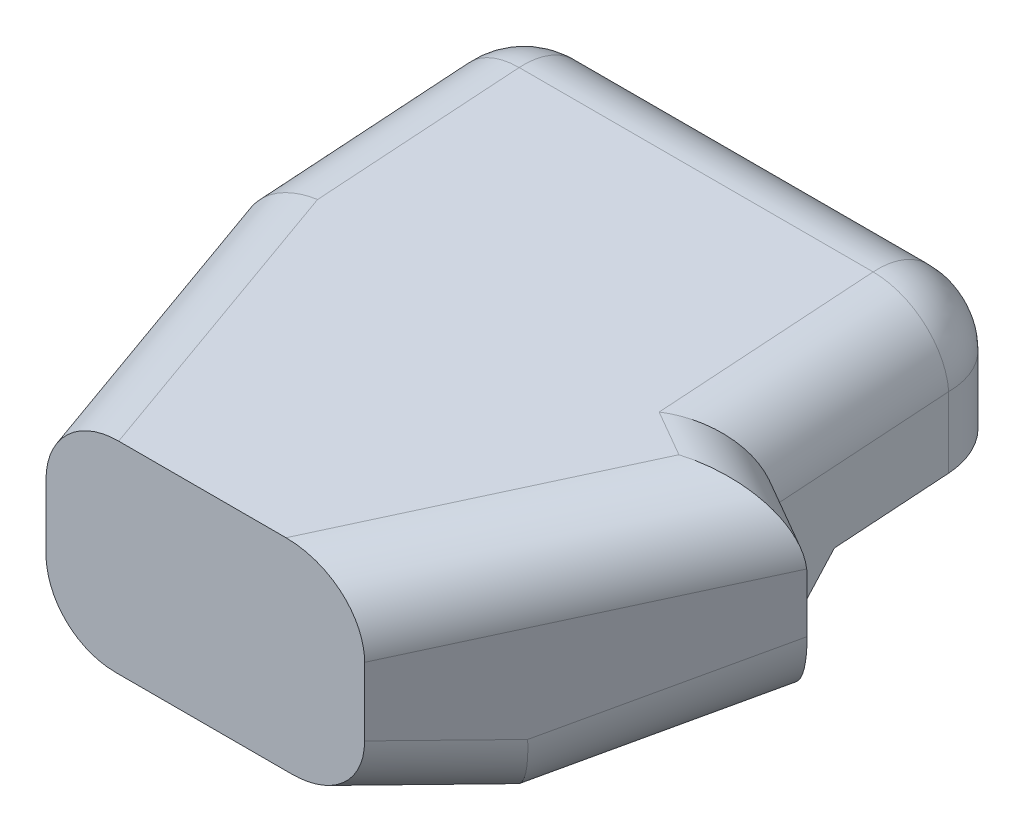
ISO-10303-21;
HEADER;
FILE_DESCRIPTION(('STEP AP214'),'2;1');
FILE_NAME('part.step','',(''),(''),'','','');
FILE_SCHEMA(('AUTOMOTIVE_DESIGN { 1 0 10303 214 1 1 1 1 }'));
ENDSEC;
DATA;
#1=APPLICATION_CONTEXT('core data for automotive mechanical design processes');
#2=APPLICATION_PROTOCOL_DEFINITION('international standard','automotive_design',2000,#1);
#3=PRODUCT_CONTEXT('',#1,'mechanical');
#4=PRODUCT('Part','Part','',(#3));
#5=PRODUCT_RELATED_PRODUCT_CATEGORY('part','',(#4));
#6=PRODUCT_DEFINITION_FORMATION('','',#4);
#7=PRODUCT_DEFINITION_CONTEXT('part definition',#1,'design');
#8=PRODUCT_DEFINITION('design','',#6,#7);
#9=PRODUCT_DEFINITION_SHAPE('','',#8);
#10=(LENGTH_UNIT() NAMED_UNIT(*) SI_UNIT(.MILLI.,.METRE.));
#11=(NAMED_UNIT(*) PLANE_ANGLE_UNIT() SI_UNIT($,.RADIAN.));
#12=(NAMED_UNIT(*) SI_UNIT($,.STERADIAN.) SOLID_ANGLE_UNIT());
#13=UNCERTAINTY_MEASURE_WITH_UNIT(LENGTH_MEASURE(1.E-05),#10,'distance_accuracy_value','');
#14=(GEOMETRIC_REPRESENTATION_CONTEXT(3) GLOBAL_UNCERTAINTY_ASSIGNED_CONTEXT((#13)) GLOBAL_UNIT_ASSIGNED_CONTEXT((#10,
#11,#12)) REPRESENTATION_CONTEXT('',''));
#15=CARTESIAN_POINT('',(0.,0.,0.));
#16=DIRECTION('',(0.,0.,1.));
#17=DIRECTION('',(1.,0.,0.));
#18=AXIS2_PLACEMENT_3D('',#15,#16,#17);
#19=CARTESIAN_POINT('',(-44.45,48.26,-50.8));
#20=DIRECTION('',(1.,0.,0.));
#21=DIRECTION('',(0.,0.,-1.));
#22=AXIS2_PLACEMENT_3D('',#19,#20,#21);
#23=PLANE('',#22);
#24=DIRECTION('',(0.,0.741365955623749,-0.671100975891173));
#25=VECTOR('',#24,1.);
#26=CARTESIAN_POINT('',(-44.45,27.062088622232,-74.2173550484524));
#27=LINE('',#26,#25);
#28=CARTESIAN_POINT('',(-44.45,15.2004808970908,-63.4799635353998));
#29=VERTEX_POINT('',#28);
#30=CARTESIAN_POINT('',(-44.45,20.6329834358397,-68.3975858346573));
#31=VERTEX_POINT('',#30);
#32=EDGE_CURVE('E188',#29,#31,#27,.T.);
#33=ORIENTED_EDGE('',*,*,#32,.F.);
#34=CARTESIAN_POINT('',(-44.45,32.1617140550632,-93.3781587201701));
#35=DIRECTION('',(1.,0.,0.));
#36=DIRECTION('',(0.,-0.268871544476507,0.963176044433632));
#37=AXIS2_PLACEMENT_3D('',#34,#35,#36);
#38=ELLIPSE('',#37,44.0636100522988,12.7);
#39=CARTESIAN_POINT('',(-44.45,21.3334287185706,-50.8));
#40=VERTEX_POINT('',#39);
#41=EDGE_CURVE('E287',#29,#40,#38,.F.);
#42=ORIENTED_EDGE('',*,*,#41,.T.);
#43=DIRECTION('',(0.,-1.,0.));
#44=VECTOR('',#43,1.);
#45=CARTESIAN_POINT('',(-44.45,48.26,-50.8));
#46=LINE('',#45,#44);
#47=CARTESIAN_POINT('',(-44.45,32.1241080736787,-50.8));
#48=VERTEX_POINT('',#47);
#49=EDGE_CURVE('E199',#48,#40,#46,.T.);
#50=ORIENTED_EDGE('',*,*,#49,.F.);
#51=DIRECTION('',(0.,-0.0669235621427186,0.997758105369297));
#52=VECTOR('',#51,1.);
#53=CARTESIAN_POINT('',(-44.45,35.5884720618099,-102.449929239212));
#54=LINE('',#53,#52);
#55=CARTESIAN_POINT('',(-44.45,34.6796249909718,-88.9));
#56=VERTEX_POINT('',#55);
#57=EDGE_CURVE('E259',#48,#56,#54,.F.);
#58=ORIENTED_EDGE('',*,*,#57,.T.);
#59=DIRECTION('',(0.,-1.,0.));
#60=VECTOR('',#59,1.);
#61=CARTESIAN_POINT('',(-44.45,48.26,-88.9));
#62=LINE('',#61,#60);
#63=CARTESIAN_POINT('',(-44.45,22.008161027569,-88.9));
#64=VERTEX_POINT('',#63);
#65=EDGE_CURVE('E261',#56,#64,#62,.T.);
#66=ORIENTED_EDGE('',*,*,#65,.T.);
#67=DIRECTION('',(0.,0.0669235621427186,-0.997758105369297));
#68=VECTOR('',#67,1.);
#69=CARTESIAN_POINT('',(-44.45,19.5816654348561,-52.7235687438587));
#70=LINE('',#69,#68);
#71=EDGE_CURVE('E218',#31,#64,#70,.T.);
#72=ORIENTED_EDGE('',*,*,#71,.F.);
#73=EDGE_LOOP('',(#33,#42,#50,#58,#66,#72));
#74=FACE_BOUND('',#73,.T.);
#75=ADVANCED_FACE('F40',(#74),#23,.F.);
#76=CARTESIAN_POINT('',(-28.575,48.26,0.));
#77=DIRECTION('',(0.95447997803503,0.,-0.298274993135947));
#78=DIRECTION('',(-0.298274993135947,0.,-0.95447997803503));
#79=AXIS2_PLACEMENT_3D('',#76,#77,#78);
#80=PLANE('',#79);
#81=ORIENTED_EDGE('',*,*,#49,.T.);
#82=DIRECTION('',(-0.288219689329278,0.257461795372023,-0.922303005853689));
#83=VECTOR('',#82,1.);
#84=CARTESIAN_POINT('',(-35.4555907010625,13.29887434165,-22.0178902434001));
#85=LINE('',#84,#83);
#86=CARTESIAN_POINT('',(-35.1883635531592,13.0601648300568,-21.1627633701095));
#87=VERTEX_POINT('',#86);
#88=EDGE_CURVE('E291',#40,#87,#85,.F.);
#89=ORIENTED_EDGE('',*,*,#88,.T.);
#90=DIRECTION('',(-0.292654151843761,-0.193219752801737,-0.936493285900035));
#91=VECTOR('',#90,1.);
#92=CARTESIAN_POINT('',(-29.2640722899567,16.971573864201,-2.2050313278613));
#93=LINE('',#92,#91);
#94=CARTESIAN_POINT('',(-28.575,17.4265217154074,0.));
#95=VERTEX_POINT('',#94);
#96=EDGE_CURVE('E289',#87,#95,#93,.F.);
#97=ORIENTED_EDGE('',*,*,#96,.T.);
#98=DIRECTION('',(0.,-1.,0.));
#99=VECTOR('',#98,1.);
#100=CARTESIAN_POINT('',(-28.575,48.26,0.));
#101=LINE('',#100,#99);
#102=CARTESIAN_POINT('',(-28.575,28.9708344476093,0.));
#103=VERTEX_POINT('',#102);
#104=EDGE_CURVE('E232',#103,#95,#101,.T.);
#105=ORIENTED_EDGE('',*,*,#104,.F.);
#106=DIRECTION('',(0.297665602820913,-0.0638899303899297,0.952529929026922));
#107=VECTOR('',#106,1.);
#108=CARTESIAN_POINT('',(-44.6872370991244,32.4291100996618,-51.5591587171979));
#109=LINE('',#108,#107);
#110=CARTESIAN_POINT('',(-44.4474694857825,32.3776471963871,-50.791902354504));
#111=VERTEX_POINT('',#110);
#112=EDGE_CURVE('E277',#103,#111,#109,.F.);
#113=ORIENTED_EDGE('',*,*,#112,.T.);
#114=CARTESIAN_POINT('',(-31.75,29.3982233618993,-10.16));
#115=DIRECTION('',(0.95447997803503,0.,-0.298274993135947));
#116=DIRECTION('',(-0.297541229968866,0.0700998795093561,-0.952131935900371));
#117=AXIS2_PLACEMENT_3D('',#114,#115,#116);
#118=ELLIPSE('',#117,42.6738289481605,12.7);
#119=EDGE_CURVE('E279',#111,#48,#118,.F.);
#120=ORIENTED_EDGE('',*,*,#119,.T.);
#121=EDGE_LOOP('',(#81,#89,#97,#105,#113,#120));
#122=FACE_BOUND('',#121,.T.);
#123=ADVANCED_FACE('F396',(#122),#80,.F.);
#124=CARTESIAN_POINT('',(28.575,48.26,0.));
#125=DIRECTION('',(0.,0.,-1.));
#126=DIRECTION('',(-1.,0.,0.));
#127=AXIS2_PLACEMENT_3D('',#124,#125,#126);
#128=PLANE('',#127);
#129=ORIENTED_EDGE('',*,*,#104,.T.);
#130=CARTESIAN_POINT('',(-15.2693253999468,18.2080908847934,0.));
#131=DIRECTION('',(0.,0.,-1.));
#132=DIRECTION('',(0.834520233187556,0.550977295721509,0.));
#133=AXIS2_PLACEMENT_3D('',#130,#131,#132);
#134=ELLIPSE('',#133,13.5612290992502,12.7);
#135=CARTESIAN_POINT('',(-16.0712770544389,5.24059466848969,0.));
#136=VERTEX_POINT('',#135);
#137=EDGE_CURVE('E303',#95,#136,#134,.F.);
#138=ORIENTED_EDGE('',*,*,#137,.T.);
#139=DIRECTION('',(-1.,0.,0.));
#140=VECTOR('',#139,1.);
#141=CARTESIAN_POINT('',(82.55,5.24059466848969,0.));
#142=LINE('',#141,#140);
#143=CARTESIAN_POINT('',(15.4471999259788,5.24059466848969,0.));
#144=VERTEX_POINT('',#143);
#145=EDGE_CURVE('E216',#144,#136,#142,.T.);
#146=ORIENTED_EDGE('',*,*,#145,.F.);
#147=CARTESIAN_POINT('',(14.0036869478931,18.2080908847934,0.));
#148=DIRECTION('',(0.,0.,-1.));
#149=DIRECTION('',(0.938837131961839,-0.344361495596806,0.));
#150=AXIS2_PLACEMENT_3D('',#147,#148,#149);
#151=ELLIPSE('',#150,14.8050370544065,12.7);
#152=CARTESIAN_POINT('',(28.575,16.9234606655006,0.));
#153=VERTEX_POINT('',#152);
#154=EDGE_CURVE('E301',#144,#153,#151,.F.);
#155=ORIENTED_EDGE('',*,*,#154,.T.);
#156=DIRECTION('',(0.,-1.,0.));
#157=VECTOR('',#156,1.);
#158=CARTESIAN_POINT('',(28.575,48.26,0.));
#159=LINE('',#158,#157);
#160=CARTESIAN_POINT('',(28.575,29.1343758145459,0.));
#161=VERTEX_POINT('',#160);
#162=EDGE_CURVE('E230',#161,#153,#159,.T.);
#163=ORIENTED_EDGE('',*,*,#162,.F.);
#164=CARTESIAN_POINT('',(14.0036869478931,28.7167521839545,0.));
#165=DIRECTION('',(0.,0.,-1.));
#166=DIRECTION('',(-0.992965534941179,-0.118403743264215,0.));
#167=AXIS2_PLACEMENT_3D('',#164,#165,#166);
#168=ELLIPSE('',#167,14.5961910681332,12.7);
#169=CARTESIAN_POINT('',(14.4817721449502,41.4452882205517,0.));
#170=VERTEX_POINT('',#169);
#171=EDGE_CURVE('E255',#161,#170,#168,.F.);
#172=ORIENTED_EDGE('',*,*,#171,.T.);
#173=DIRECTION('',(-1.,0.,0.));
#174=VECTOR('',#173,1.);
#175=CARTESIAN_POINT('',(82.55,41.4452882205517,0.));
#176=LINE('',#175,#174);
#177=CARTESIAN_POINT('',(-15.5349282872007,41.4452882205517,0.));
#178=VERTEX_POINT('',#177);
#179=EDGE_CURVE('E223',#170,#178,#176,.T.);
#180=ORIENTED_EDGE('',*,*,#179,.T.);
#181=CARTESIAN_POINT('',(-15.2693253999468,28.7167521839545,0.));
#182=DIRECTION('',(0.,0.,-1.));
#183=DIRECTION('',(-0.977732072803991,0.209857079486041,0.));
#184=AXIS2_PLACEMENT_3D('',#181,#182,#183);
#185=ELLIPSE('',#184,13.3329143924895,12.7);
#186=EDGE_CURVE('E253',#178,#103,#185,.F.);
#187=ORIENTED_EDGE('',*,*,#186,.T.);
#188=EDGE_LOOP('',(#129,#138,#146,#155,#163,#172,#180,#187));
#189=FACE_BOUND('',#188,.T.);
#190=ADVANCED_FACE('F308',(#189),#128,.F.);
#191=CARTESIAN_POINT('',(57.15,48.26,-50.8));
#192=DIRECTION('',(-0.871575537124549,0.,-0.490261239632559));
#193=DIRECTION('',(-0.490261239632559,0.,0.871575537124549));
#194=AXIS2_PLACEMENT_3D('',#191,#192,#193);
#195=PLANE('',#194);
#196=DIRECTION('',(-0.482521588682802,0.176986881195609,0.857816157658315));
#197=VECTOR('',#196,1.);
#198=CARTESIAN_POINT('',(43.8602166520565,11.3169077420727,-27.1737184925448));
#199=LINE('',#198,#197);
#200=CARTESIAN_POINT('',(39.1075526472764,13.0601648300568,-18.7245380396025));
#201=VERTEX_POINT('',#200);
#202=EDGE_CURVE('E54',#153,#201,#199,.F.);
#203=ORIENTED_EDGE('',*,*,#202,.T.);
#204=DIRECTION('',(-0.476364625502872,-0.23640472157252,0.84687044533844));
#205=VECTOR('',#204,1.);
#206=CARTESIAN_POINT('',(55.4693780752367,21.1800221360687,-47.8122276893097));
#207=LINE('',#206,#205);
#208=CARTESIAN_POINT('',(57.15,22.0140617286873,-50.8));
#209=VERTEX_POINT('',#208);
#210=EDGE_CURVE('E47',#201,#209,#207,.F.);
#211=ORIENTED_EDGE('',*,*,#210,.T.);
#212=DIRECTION('',(0.,-1.,0.));
#213=VECTOR('',#212,1.);
#214=CARTESIAN_POINT('',(57.15,48.26,-50.8));
#215=LINE('',#214,#213);
#216=CARTESIAN_POINT('',(57.15,31.3816660637385,-50.8));
#217=VERTEX_POINT('',#216);
#218=EDGE_CURVE('E187',#217,#209,#215,.T.);
#219=ORIENTED_EDGE('',*,*,#218,.F.);
#220=CARTESIAN_POINT('',(50.9236822566665,31.3816660637385,-39.7309906785182));
#221=DIRECTION('',(-0.871575537124549,0.,-0.490261239632559));
#222=DIRECTION('',(0.,-1.,0.));
#223=AXIS2_PLACEMENT_3D('',#220,#221,#222);
#224=ELLIPSE('',#223,12.7068646603648,12.7);
#225=CARTESIAN_POINT('',(57.1241369132409,32.5386477238328,-50.754021179095));
#226=VERTEX_POINT('',#225);
#227=EDGE_CURVE('E249',#217,#226,#224,.F.);
#228=ORIENTED_EDGE('',*,*,#227,.T.);
#229=DIRECTION('',(0.489425629375078,0.0583603604840991,-0.870090007777917));
#230=VECTOR('',#229,1.);
#231=CARTESIAN_POINT('',(28.9266372824396,29.1763059410679,-0.625132946559236));
#232=LINE('',#231,#230);
#233=EDGE_CURVE('E251',#226,#161,#232,.F.);
#234=ORIENTED_EDGE('',*,*,#233,.T.);
#235=ORIENTED_EDGE('',*,*,#162,.T.);
#236=EDGE_LOOP('',(#203,#211,#219,#228,#234,#235));
#237=FACE_BOUND('',#236,.T.);
#238=ADVANCED_FACE('F377',(#237),#195,.F.);
#239=CARTESIAN_POINT('',(57.15,48.26,-50.8));
#240=DIRECTION('',(-0.490261239632559,0.,0.871575537124549));
#241=DIRECTION('',(0.871575537124549,0.,0.490261239632559));
#242=AXIS2_PLACEMENT_3D('',#239,#240,#241);
#243=PLANE('',#242);
#244=ORIENTED_EDGE('',*,*,#218,.T.);
#245=CARTESIAN_POINT('',(46.0809906785182,22.0140617286873,-57.0263177433335));
#246=DIRECTION('',(-0.490261239632559,0.,0.871575537124549));
#247=DIRECTION('',(0.,1.,0.));
#248=AXIS2_PLACEMENT_3D('',#245,#246,#247);
#249=ELLIPSE('',#248,13.0704872066449,12.7);
#250=CARTESIAN_POINT('',(44.6219037926469,9.0576272161988,-57.8470541166361));
#251=VERTEX_POINT('',#250);
#252=EDGE_CURVE('E12',#209,#251,#249,.F.);
#253=ORIENTED_EDGE('',*,*,#252,.T.);
#254=DIRECTION('',(0.863526210364251,-0.13559298459543,0.485733493329891));
#255=VECTOR('',#254,1.);
#256=CARTESIAN_POINT('',(52.329534026568,7.84735638129908,-53.5115121100555));
#257=LINE('',#256,#255);
#258=CARTESIAN_POINT('',(44.45,9.08461996758088,-57.94375));
#259=VERTEX_POINT('',#258);
#260=EDGE_CURVE('E207',#259,#251,#257,.T.);
#261=ORIENTED_EDGE('',*,*,#260,.F.);
#262=DIRECTION('',(0.,-1.,0.));
#263=VECTOR('',#262,1.);
#264=CARTESIAN_POINT('',(44.45,48.26,-57.94375));
#265=LINE('',#264,#263);
#266=CARTESIAN_POINT('',(44.45,31.8608254857309,-57.94375));
#267=VERTEX_POINT('',#266);
#268=EDGE_CURVE('E177',#267,#259,#265,.T.);
#269=ORIENTED_EDGE('',*,*,#268,.F.);
#270=DIRECTION('',(-0.871104683754771,0.0328659855718789,-0.489996384612059));
#271=VECTOR('',#270,1.);
#272=CARTESIAN_POINT('',(56.76432975166,31.3962170506104,-51.0169395146912));
#273=LINE('',#272,#271);
#274=EDGE_CURVE('E257',#267,#217,#273,.F.);
#275=ORIENTED_EDGE('',*,*,#274,.T.);
#276=EDGE_LOOP('',(#244,#253,#261,#269,#275));
#277=FACE_BOUND('',#276,.T.);
#278=ADVANCED_FACE('F213',(#277),#243,.F.);
#279=CARTESIAN_POINT('',(44.45,48.26,-57.94375));
#280=DIRECTION('',(-1.,0.,0.));
#281=DIRECTION('',(0.,0.,1.));
#282=AXIS2_PLACEMENT_3D('',#279,#280,#281);
#283=PLANE('',#282);
#284=DIRECTION('',(0.,-0.0669235621427186,0.997758105369297));
#285=VECTOR('',#284,1.);
#286=CARTESIAN_POINT('',(44.45,20.0586788152768,-59.835323579464));
#287=LINE('',#286,#285);
#288=CARTESIAN_POINT('',(44.45,22.008161027569,-88.9));
#289=VERTEX_POINT('',#288);
#290=CARTESIAN_POINT('',(44.45,20.6329834358397,-68.3975858346573));
#291=VERTEX_POINT('',#290);
#292=EDGE_CURVE('E215',#289,#291,#287,.T.);
#293=ORIENTED_EDGE('',*,*,#292,.F.);
#294=DIRECTION('',(0.,-1.,0.));
#295=VECTOR('',#294,1.);
#296=CARTESIAN_POINT('',(44.45,48.26,-88.9));
#297=LINE('',#296,#295);
#298=CARTESIAN_POINT('',(44.45,34.6796249909718,-88.9));
#299=VERTEX_POINT('',#298);
#300=EDGE_CURVE('E275',#289,#299,#297,.F.);
#301=ORIENTED_EDGE('',*,*,#300,.T.);
#302=DIRECTION('',(0.,0.0669235621427186,-0.997758105369297));
#303=VECTOR('',#302,1.);
#304=CARTESIAN_POINT('',(44.45,32.6602755940782,-58.7936792392125));
#305=LINE('',#304,#303);
#306=CARTESIAN_POINT('',(44.45,32.6016034681345,-57.9189411448069));
#307=VERTEX_POINT('',#306);
#308=EDGE_CURVE('E273',#299,#307,#305,.F.);
#309=ORIENTED_EDGE('',*,*,#308,.T.);
#310=CARTESIAN_POINT('',(44.45,31.6259121935233,-43.3724369478931));
#311=DIRECTION('',(-1.,0.,0.));
#312=DIRECTION('',(0.,-0.0669235621427186,0.997758105369297));
#313=AXIS2_PLACEMENT_3D('',#310,#311,#312);
#314=ELLIPSE('',#313,14.5791892029078,12.7);
#315=EDGE_CURVE('E183',#307,#267,#314,.T.);
#316=ORIENTED_EDGE('',*,*,#315,.T.);
#317=ORIENTED_EDGE('',*,*,#268,.T.);
#318=DIRECTION('',(0.,-0.741365955623749,0.671100975891173));
#319=VECTOR('',#318,1.);
#320=CARTESIAN_POINT('',(44.45,30.616328677508,-77.4347323120743));
#321=LINE('',#320,#319);
#322=EDGE_CURVE('E181',#291,#259,#321,.T.);
#323=ORIENTED_EDGE('',*,*,#322,.F.);
#324=EDGE_LOOP('',(#293,#301,#309,#316,#317,#323));
#325=FACE_BOUND('',#324,.T.);
#326=ADVANCED_FACE('F180',(#325),#283,.F.);
#327=CARTESIAN_POINT('',(-44.45,48.26,-101.6));
#328=DIRECTION('',(0.,0.,1.));
#329=DIRECTION('',(1.,0.,0.));
#330=AXIS2_PLACEMENT_3D('',#327,#328,#329);
#331=PLANE('',#330);
#332=DIRECTION('',(-1.,0.,0.));
#333=VECTOR('',#332,1.);
#334=CARTESIAN_POINT('',(82.55,22.86,-101.6));
#335=LINE('',#334,#333);
#336=CARTESIAN_POINT('',(31.75,22.86,-101.6));
#337=VERTEX_POINT('',#336);
#338=CARTESIAN_POINT('',(-31.75,22.86,-101.6));
#339=VERTEX_POINT('',#338);
#340=EDGE_CURVE('E332',#337,#339,#335,.T.);
#341=ORIENTED_EDGE('',*,*,#340,.T.);
#342=DIRECTION('',(0.,-1.,0.));
#343=VECTOR('',#342,1.);
#344=CARTESIAN_POINT('',(-31.75,48.26,-101.6));
#345=LINE('',#344,#343);
#346=CARTESIAN_POINT('',(-31.75,34.6796249909718,-101.6));
#347=VERTEX_POINT('',#346);
#348=EDGE_CURVE('E271',#339,#347,#345,.F.);
#349=ORIENTED_EDGE('',*,*,#348,.T.);
#350=DIRECTION('',(-1.,0.,0.));
#351=VECTOR('',#350,1.);
#352=CARTESIAN_POINT('',(44.45,34.6796249909718,-101.6));
#353=LINE('',#352,#351);
#354=CARTESIAN_POINT('',(31.75,34.6796249909718,-101.6));
#355=VERTEX_POINT('',#354);
#356=EDGE_CURVE('E267',#347,#355,#353,.F.);
#357=ORIENTED_EDGE('',*,*,#356,.T.);
#358=DIRECTION('',(0.,-1.,0.));
#359=VECTOR('',#358,1.);
#360=CARTESIAN_POINT('',(31.75,48.26,-101.6));
#361=LINE('',#360,#359);
#362=EDGE_CURVE('E269',#355,#337,#361,.T.);
#363=ORIENTED_EDGE('',*,*,#362,.T.);
#364=EDGE_LOOP('',(#341,#349,#357,#363));
#365=FACE_BOUND('',#364,.T.);
#366=ADVANCED_FACE('F432',(#365),#331,.F.);
#367=CARTESIAN_POINT('',(82.55,41.4452882205517,0.));
#368=DIRECTION('',(0.,0.997758105369297,0.0669235621427186));
#369=DIRECTION('',(0.,-0.0669235621427186,0.997758105369297));
#370=AXIS2_PLACEMENT_3D('',#367,#368,#369);
#371=PLANE('',#370);
#372=ORIENTED_EDGE('',*,*,#179,.F.);
#373=DIRECTION('',(0.489425629375078,0.0583603604840991,-0.870090007777917));
#374=VECTOR('',#373,1.);
#375=CARTESIAN_POINT('',(46.4326279609578,45.2551897689821,-56.8015214506802));
#376=LINE('',#375,#374);
#377=CARTESIAN_POINT('',(39.8546729351847,44.4708176325199,-45.1073791826392));
#378=VERTEX_POINT('',#377);
#379=EDGE_CURVE('E246',#170,#378,#376,.T.);
#380=ORIENTED_EDGE('',*,*,#379,.T.);
#381=DIRECTION('',(-0.871104683754771,0.0328659855718789,-0.489996384612059));
#382=VECTOR('',#381,1.);
#383=CARTESIAN_POINT('',(37.8380120083265,44.546904410793,-46.2417509539969));
#384=LINE('',#383,#382);
#385=CARTESIAN_POINT('',(31.75,44.7765995537058,-49.6662577086806));
#386=VERTEX_POINT('',#385);
#387=EDGE_CURVE('E244',#378,#386,#384,.T.);
#388=ORIENTED_EDGE('',*,*,#387,.T.);
#389=DIRECTION('',(0.,0.0669235621427186,-0.997758105369297));
#390=VECTOR('',#389,1.);
#391=CARTESIAN_POINT('',(31.75,48.26,-101.6));
#392=LINE('',#391,#390);
#393=CARTESIAN_POINT('',(31.75,47.3511529291619,-88.0500707607874));
#394=VERTEX_POINT('',#393);
#395=EDGE_CURVE('E242',#386,#394,#392,.T.);
#396=ORIENTED_EDGE('',*,*,#395,.T.);
#397=DIRECTION('',(-1.,0.,0.));
#398=VECTOR('',#397,1.);
#399=CARTESIAN_POINT('',(-44.45,47.3511529291619,-88.0500707607874));
#400=LINE('',#399,#398);
#401=CARTESIAN_POINT('',(-31.75,47.3511529291619,-88.0500707607874));
#402=VERTEX_POINT('',#401);
#403=EDGE_CURVE('E240',#394,#402,#400,.T.);
#404=ORIENTED_EDGE('',*,*,#403,.T.);
#405=DIRECTION('',(0.,-0.0669235621427186,0.997758105369297));
#406=VECTOR('',#405,1.);
#407=CARTESIAN_POINT('',(-31.75,44.8526441102758,-50.8));
#408=LINE('',#407,#406);
#409=CARTESIAN_POINT('',(-31.75,44.9256359435694,-51.8882294809576));
#410=VERTEX_POINT('',#409);
#411=EDGE_CURVE('E238',#402,#410,#408,.T.);
#412=ORIENTED_EDGE('',*,*,#411,.T.);
#413=DIRECTION('',(0.297665602820913,-0.0638899303899297,0.952529929026922));
#414=VECTOR('',#413,1.);
#415=CARTESIAN_POINT('',(-16.6903413780795,41.6932821481277,-3.69732189081193));
#416=LINE('',#415,#414);
#417=EDGE_CURVE('E198',#410,#178,#416,.T.);
#418=ORIENTED_EDGE('',*,*,#417,.T.);
#419=EDGE_LOOP('',(#372,#380,#388,#396,#404,#412,#418));
#420=FACE_BOUND('',#419,.T.);
#421=ADVANCED_FACE('F390',(#420),#371,.T.);
#422=CARTESIAN_POINT('',(82.55,9.08461996758088,-57.94375));
#423=DIRECTION('',(0.,-0.671100975891173,-0.741365955623749));
#424=DIRECTION('',(0.,0.741365955623749,-0.671100975891173));
#425=AXIS2_PLACEMENT_3D('',#422,#423,#424);
#426=PLANE('',#425);
#427=DIRECTION('',(-1.,0.,0.));
#428=VECTOR('',#427,1.);
#429=CARTESIAN_POINT('',(82.55,9.08461996758088,-57.94375));
#430=LINE('',#429,#428);
#431=CARTESIAN_POINT('',(-32.3096633328057,9.08461996758088,-57.94375));
#432=VERTEX_POINT('',#431);
#433=EDGE_CURVE('E195',#259,#432,#430,.T.);
#434=ORIENTED_EDGE('',*,*,#433,.T.);
#435=CARTESIAN_POINT('',(-38.3679436075628,26.7287154906875,-73.9155782643712));
#436=DIRECTION('',(0.,-0.671100975891173,-0.741365955623749));
#437=DIRECTION('',(0.335298286231136,-0.69844977841403,0.632252296384803));
#438=AXIS2_PLACEMENT_3D('',#435,#436,#437);
#439=ELLIPSE('',#438,24.8541439853702,12.7);
#440=EDGE_CURVE('E285',#432,#29,#439,.T.);
#441=ORIENTED_EDGE('',*,*,#440,.T.);
#442=ORIENTED_EDGE('',*,*,#32,.T.);
#443=DIRECTION('',(-1.,0.,0.));
#444=VECTOR('',#443,1.);
#445=CARTESIAN_POINT('',(82.55,20.6329834358397,-68.3975858346573));
#446=LINE('',#445,#444);
#447=EDGE_CURVE('E197',#291,#31,#446,.T.);
#448=ORIENTED_EDGE('',*,*,#447,.F.);
#449=ORIENTED_EDGE('',*,*,#322,.T.);
#450=EDGE_LOOP('',(#434,#441,#442,#448,#449));
#451=FACE_BOUND('',#450,.T.);
#452=ADVANCED_FACE('F194',(#451),#426,.T.);
#453=CARTESIAN_POINT('',(82.55,20.6329834358397,-68.3975858346573));
#454=DIRECTION('',(0.,-0.997758105369297,-0.0669235621427186));
#455=DIRECTION('',(0.,0.0669235621427186,-0.997758105369297));
#456=AXIS2_PLACEMENT_3D('',#453,#454,#455);
#457=PLANE('',#456);
#458=ORIENTED_EDGE('',*,*,#71,.T.);
#459=CARTESIAN_POINT('',(-31.75,22.008161027569,-88.9));
#460=DIRECTION('',(0.,-0.997758105369297,-0.0669235621427186));
#461=DIRECTION('',(0.,-0.0669235621427186,0.997758105369297));
#462=AXIS2_PLACEMENT_3D('',#459,#460,#461);
#463=ELLIPSE('',#462,12.7285360365972,12.7);
#464=EDGE_CURVE('E265',#64,#339,#463,.T.);
#465=ORIENTED_EDGE('',*,*,#464,.T.);
#466=ORIENTED_EDGE('',*,*,#340,.F.);
#467=CARTESIAN_POINT('',(31.75,22.008161027569,-88.9));
#468=DIRECTION('',(0.,-0.997758105369297,-0.0669235621427186));
#469=DIRECTION('',(0.,-0.0669235621427186,0.997758105369297));
#470=AXIS2_PLACEMENT_3D('',#467,#468,#469);
#471=ELLIPSE('',#470,12.7285360365972,12.7);
#472=EDGE_CURVE('E263',#337,#289,#471,.T.);
#473=ORIENTED_EDGE('',*,*,#472,.T.);
#474=ORIENTED_EDGE('',*,*,#292,.T.);
#475=ORIENTED_EDGE('',*,*,#447,.T.);
#476=EDGE_LOOP('',(#458,#465,#466,#473,#474,#475));
#477=FACE_BOUND('',#476,.T.);
#478=ADVANCED_FACE('F404',(#477),#457,.T.);
#479=CARTESIAN_POINT('',(82.55,5.24059466848969,0.));
#480=DIRECTION('',(0.,-0.979371791451354,0.202066558612172));
#481=DIRECTION('',(0.,-0.202066558612172,-0.979371791451354));
#482=AXIS2_PLACEMENT_3D('',#479,#480,#481);
#483=PLANE('',#482);
#484=DIRECTION('',(-0.292654151843761,-0.193219752801737,-0.936493285900035));
#485=VECTOR('',#484,1.);
#486=CARTESIAN_POINT('',(-25.0796765689118,-0.707042555720922,-28.8268784463132));
#487=LINE('',#486,#485);
#488=CARTESIAN_POINT('',(-23.9250323951995,0.0552909372881425,-25.1320170904338));
#489=VERTEX_POINT('',#488);
#490=EDGE_CURVE('E297',#136,#489,#487,.T.);
#491=ORIENTED_EDGE('',*,*,#490,.T.);
#492=CARTESIAN_POINT('',(-14.7192735444232,5.60375672473534,1.76016593767556));
#493=DIRECTION('',(0.,-0.979371791451354,0.202066558612172));
#494=DIRECTION('',(0.320699245528422,0.191393620749627,0.927642428877554));
#495=AXIS2_PLACEMENT_3D('',#492,#493,#494);
#496=ELLIPSE('',#495,28.9612215845353,12.7);
#497=CARTESIAN_POINT('',(-22.1397414578057,0.,-25.4));
#498=VERTEX_POINT('',#497);
#499=EDGE_CURVE('E299',#489,#498,#496,.T.);
#500=ORIENTED_EDGE('',*,*,#499,.T.);
#501=DIRECTION('',(-1.,0.,0.));
#502=VECTOR('',#501,1.);
#503=CARTESIAN_POINT('',(82.55,0.,-25.4));
#504=LINE('',#503,#502);
#505=CARTESIAN_POINT('',(26.3704358520391,0.,-25.4));
#506=VERTEX_POINT('',#505);
#507=EDGE_CURVE('E211',#506,#498,#504,.T.);
#508=ORIENTED_EDGE('',*,*,#507,.F.);
#509=CARTESIAN_POINT('',(13.0135936079506,5.60375672473534,1.76016593767556));
#510=DIRECTION('',(0.,-0.979371791451354,0.202066558612172));
#511=DIRECTION('',(0.520416304141384,-0.172547197232235,-0.83629799420489));
#512=AXIS2_PLACEMENT_3D('',#509,#510,#511);
#513=ELLIPSE('',#512,31.5408594875889,12.7);
#514=CARTESIAN_POINT('',(29.3273892594226,0.149399832551077,-24.6758921483445));
#515=VERTEX_POINT('',#514);
#516=EDGE_CURVE('E295',#506,#515,#513,.T.);
#517=ORIENTED_EDGE('',*,*,#516,.T.);
#518=DIRECTION('',(-0.482521588682802,0.176986881195609,0.857816157658315));
#519=VECTOR('',#518,1.);
#520=CARTESIAN_POINT('',(18.5037073305747,4.11948065913016,-5.43379094150374));
#521=LINE('',#520,#519);
#522=EDGE_CURVE('E293',#515,#144,#521,.T.);
#523=ORIENTED_EDGE('',*,*,#522,.T.);
#524=ORIENTED_EDGE('',*,*,#145,.T.);
#525=EDGE_LOOP('',(#491,#500,#508,#517,#523,#524));
#526=FACE_BOUND('',#525,.T.);
#527=ADVANCED_FACE('F315',(#526),#483,.T.);
#528=CARTESIAN_POINT('',(82.55,0.,-25.4));
#529=DIRECTION('',(0.,-0.963176044433632,-0.268871544476507));
#530=DIRECTION('',(0.,0.268871544476507,-0.963176044433632));
#531=AXIS2_PLACEMENT_3D('',#528,#529,#530);
#532=PLANE('',#531);
#533=ORIENTED_EDGE('',*,*,#507,.T.);
#534=DIRECTION('',(-0.288219689329278,0.257461795372023,-0.922303005853689));
#535=VECTOR('',#534,1.);
#536=CARTESIAN_POINT('',(-31.2711949800177,8.15697367399133,-54.6206512710783));
#537=LINE('',#536,#535);
#538=EDGE_CURVE('E210',#498,#432,#537,.T.);
#539=ORIENTED_EDGE('',*,*,#538,.T.);
#540=ORIENTED_EDGE('',*,*,#433,.F.);
#541=ORIENTED_EDGE('',*,*,#260,.T.);
#542=DIRECTION('',(-0.476364625502872,-0.23640472157252,0.84687044533844));
#543=VECTOR('',#542,1.);
#544=CARTESIAN_POINT('',(30.1128687537549,1.85725127511308,-32.0532140474948));
#545=LINE('',#544,#543);
#546=EDGE_CURVE('E282',#251,#506,#545,.T.);
#547=ORIENTED_EDGE('',*,*,#546,.T.);
#548=EDGE_LOOP('',(#533,#539,#540,#541,#547));
#549=FACE_BOUND('',#548,.T.);
#550=ADVANCED_FACE('F205',(#549),#532,.T.);
#551=CARTESIAN_POINT('',(-6.84413174428775,26.908397335156,26.960619698109));
#552=DIRECTION('',(-0.297665602820913,0.0638899303899297,-0.952529929026922));
#553=DIRECTION('',(-0.95447997803503,0.,0.298274993135947));
#554=AXIS2_PLACEMENT_3D('',#551,#552,#553);
#555=CYLINDRICAL_SURFACE('',#554,12.7);
#556=ORIENTED_EDGE('',*,*,#186,.F.);
#557=ORIENTED_EDGE('',*,*,#417,.F.);
#558=CARTESIAN_POINT('',(-31.75,32.2541080053793,-52.7381587201701));
#559=DIRECTION('',(-0.150548664855925,0.0661608074943721,-0.986386256525197));
#560=DIRECTION('',(-0.988602599384656,-0.0100752529279888,0.150211150612525));
#561=AXIS2_PLACEMENT_3D('',#558,#559,#560);
#562=ELLIPSE('',#561,12.8464157467368,12.7);
#563=EDGE_CURVE('E338',#111,#410,#562,.T.);
#564=ORIENTED_EDGE('',*,*,#563,.F.);
#565=ORIENTED_EDGE('',*,*,#112,.F.);
#566=EDGE_LOOP('',(#556,#557,#564,#565));
#567=FACE_BOUND('',#566,.T.);
#568=ADVANCED_FACE('F393',(#567),#555,.T.);
#569=CARTESIAN_POINT('',(-31.75,28.7737602823616,-0.849929239212519));
#570=DIRECTION('',(0.,0.0669235621427186,-0.997758105369297));
#571=DIRECTION('',(0.,0.997758105369297,0.0669235621427186));
#572=AXIS2_PLACEMENT_3D('',#569,#570,#571);
#573=CYLINDRICAL_SURFACE('',#572,12.7);
#574=ORIENTED_EDGE('',*,*,#563,.T.);
#575=ORIENTED_EDGE('',*,*,#411,.F.);
#576=CARTESIAN_POINT('',(-31.75,34.6796249909718,-88.9));
#577=DIRECTION('',(0.,0.0669235621427195,-0.997758105369297));
#578=DIRECTION('',(0.,0.997758105369297,0.0669235621427196));
#579=AXIS2_PLACEMENT_3D('',#576,#577,#578);
#580=CIRCLE('',#579,12.7);
#581=EDGE_CURVE('E342',#56,#402,#580,.T.);
#582=ORIENTED_EDGE('',*,*,#581,.F.);
#583=ORIENTED_EDGE('',*,*,#57,.F.);
#584=ORIENTED_EDGE('',*,*,#119,.F.);
#585=EDGE_LOOP('',(#574,#575,#582,#583,#584));
#586=FACE_BOUND('',#585,.T.);
#587=ADVANCED_FACE('F428',(#586),#573,.T.);
#588=CARTESIAN_POINT('',(-31.75,48.26,-88.9));
#589=DIRECTION('',(0.,-1.,0.));
#590=DIRECTION('',(0.,0.,-1.));
#591=AXIS2_PLACEMENT_3D('',#588,#589,#590);
#592=CYLINDRICAL_SURFACE('',#591,12.7);
#593=ORIENTED_EDGE('',*,*,#464,.F.);
#594=ORIENTED_EDGE('',*,*,#65,.F.);
#595=CARTESIAN_POINT('',(-31.75,34.6796249909718,-88.9));
#596=DIRECTION('',(0.,1.,0.));
#597=DIRECTION('',(-1.,0.,0.));
#598=AXIS2_PLACEMENT_3D('',#595,#596,#597);
#599=CIRCLE('',#598,12.7);
#600=EDGE_CURVE('E348',#347,#56,#599,.T.);
#601=ORIENTED_EDGE('',*,*,#600,.F.);
#602=ORIENTED_EDGE('',*,*,#348,.F.);
#603=EDGE_LOOP('',(#593,#594,#601,#602));
#604=FACE_BOUND('',#603,.T.);
#605=ADVANCED_FACE('F431',(#604),#592,.T.);
#606=CARTESIAN_POINT('',(-31.75,34.6796249909718,-88.9));
#607=DIRECTION('',(0.,0.,1.));
#608=DIRECTION('',(1.,0.,0.));
#609=AXIS2_PLACEMENT_3D('',#606,#607,#608);
#610=SPHERICAL_SURFACE('',#609,12.7);
#611=ORIENTED_EDGE('',*,*,#600,.T.);
#612=ORIENTED_EDGE('',*,*,#581,.T.);
#613=CARTESIAN_POINT('',(-31.75,34.6796249909718,-88.9));
#614=DIRECTION('',(-1.,0.,0.));
#615=DIRECTION('',(0.,0.,1.));
#616=AXIS2_PLACEMENT_3D('',#613,#614,#615);
#617=CIRCLE('',#616,12.7);
#618=EDGE_CURVE('E353',#347,#402,#617,.F.);
#619=ORIENTED_EDGE('',*,*,#618,.F.);
#620=EDGE_LOOP('',(#611,#612,#619));
#621=FACE_BOUND('',#620,.T.);
#622=ADVANCED_FACE('F425',(#621),#610,.T.);
#623=CARTESIAN_POINT('',(82.55,34.6796249909718,-88.9));
#624=DIRECTION('',(1.,0.,0.));
#625=DIRECTION('',(0.,1.,0.));
#626=AXIS2_PLACEMENT_3D('',#623,#624,#625);
#627=CYLINDRICAL_SURFACE('',#626,12.7);
#628=ORIENTED_EDGE('',*,*,#618,.T.);
#629=ORIENTED_EDGE('',*,*,#403,.F.);
#630=CARTESIAN_POINT('',(31.75,34.6796249909718,-88.9));
#631=DIRECTION('',(1.,0.,0.));
#632=DIRECTION('',(0.,1.,0.));
#633=AXIS2_PLACEMENT_3D('',#630,#631,#632);
#634=CIRCLE('',#633,12.7);
#635=EDGE_CURVE('E356',#355,#394,#634,.T.);
#636=ORIENTED_EDGE('',*,*,#635,.F.);
#637=ORIENTED_EDGE('',*,*,#356,.F.);
#638=EDGE_LOOP('',(#628,#629,#636,#637));
#639=FACE_BOUND('',#638,.T.);
#640=ADVANCED_FACE('F421',(#639),#627,.T.);
#641=CARTESIAN_POINT('',(31.75,48.26,-88.9));
#642=DIRECTION('',(0.,-1.,0.));
#643=DIRECTION('',(0.,0.,-1.));
#644=AXIS2_PLACEMENT_3D('',#641,#642,#643);
#645=CYLINDRICAL_SURFACE('',#644,12.7);
#646=ORIENTED_EDGE('',*,*,#472,.F.);
#647=ORIENTED_EDGE('',*,*,#362,.F.);
#648=CARTESIAN_POINT('',(31.75,34.6796249909718,-88.9));
#649=DIRECTION('',(0.,1.,0.));
#650=DIRECTION('',(0.,0.,1.));
#651=AXIS2_PLACEMENT_3D('',#648,#649,#650);
#652=CIRCLE('',#651,12.7);
#653=EDGE_CURVE('E359',#299,#355,#652,.T.);
#654=ORIENTED_EDGE('',*,*,#653,.F.);
#655=ORIENTED_EDGE('',*,*,#300,.F.);
#656=EDGE_LOOP('',(#646,#647,#654,#655));
#657=FACE_BOUND('',#656,.T.);
#658=ADVANCED_FACE('F410',(#657),#645,.T.);
#659=CARTESIAN_POINT('',(31.75,34.6796249909718,-88.9));
#660=DIRECTION('',(0.,0.,1.));
#661=DIRECTION('',(1.,0.,0.));
#662=AXIS2_PLACEMENT_3D('',#659,#660,#661);
#663=SPHERICAL_SURFACE('',#662,12.7);
#664=ORIENTED_EDGE('',*,*,#653,.T.);
#665=ORIENTED_EDGE('',*,*,#635,.T.);
#666=CARTESIAN_POINT('',(31.75,34.6796249909718,-88.9));
#667=DIRECTION('',(0.,0.0669235621427184,-0.997758105369297));
#668=DIRECTION('',(0.,0.997758105369297,0.0669235621427184));
#669=AXIS2_PLACEMENT_3D('',#666,#667,#668);
#670=CIRCLE('',#669,12.7);
#671=EDGE_CURVE('E362',#299,#394,#670,.F.);
#672=ORIENTED_EDGE('',*,*,#671,.F.);
#673=EDGE_LOOP('',(#664,#665,#672));
#674=FACE_BOUND('',#673,.T.);
#675=ADVANCED_FACE('F416',(#674),#663,.T.);
#676=CARTESIAN_POINT('',(31.75,28.7737602823616,-0.849929239212496));
#677=DIRECTION('',(0.,-0.0669235621427186,0.997758105369297));
#678=DIRECTION('',(0.,-0.997758105369297,-0.0669235621427186));
#679=AXIS2_PLACEMENT_3D('',#676,#677,#678);
#680=CYLINDRICAL_SURFACE('',#679,12.7);
#681=ORIENTED_EDGE('',*,*,#671,.T.);
#682=ORIENTED_EDGE('',*,*,#395,.F.);
#683=CARTESIAN_POINT('',(31.75,32.1050716155157,-50.5161869478931));
#684=DIRECTION('',(0.504431673680324,-0.0577852576254171,0.861515844653615));
#685=DIRECTION('',(0.863451612186848,0.0337583644603007,-0.503300791019544));
#686=AXIS2_PLACEMENT_3D('',#683,#684,#685);
#687=ELLIPSE('',#686,14.7084096210498,12.7);
#688=EDGE_CURVE('E365',#307,#386,#687,.T.);
#689=ORIENTED_EDGE('',*,*,#688,.F.);
#690=ORIENTED_EDGE('',*,*,#308,.F.);
#691=EDGE_LOOP('',(#681,#682,#689,#690));
#692=FACE_BOUND('',#691,.T.);
#693=ADVANCED_FACE('F418',(#692),#680,.T.);
#694=CARTESIAN_POINT('',(91.5930550317976,29.8472477053347,-16.8544684925069));
#695=DIRECTION('',(0.871104683754771,-0.0328659855718789,0.489996384612059));
#696=DIRECTION('',(0.490261239632559,0.,-0.871575537124549));
#697=AXIS2_PLACEMENT_3D('',#694,#695,#696);
#698=CYLINDRICAL_SURFACE('',#697,12.7);
#699=ORIENTED_EDGE('',*,*,#688,.T.);
#700=ORIENTED_EDGE('',*,*,#387,.F.);
#701=CARTESIAN_POINT('',(39.8546729351847,31.7992896943298,-45.9573084218517));
#702=DIRECTION('',(0.269629387342928,-0.0644449924992162,0.960805306200405));
#703=DIRECTION('',(0.962964170403592,0.0180445590593476,-0.269024906667164));
#704=AXIS2_PLACEMENT_3D('',#701,#702,#703);
#705=ELLIPSE('',#704,17.9433122146059,12.7);
#706=EDGE_CURVE('E324',#226,#378,#705,.T.);
#707=ORIENTED_EDGE('',*,*,#706,.F.);
#708=ORIENTED_EDGE('',*,*,#227,.F.);
#709=ORIENTED_EDGE('',*,*,#274,.F.);
#710=ORIENTED_EDGE('',*,*,#315,.F.);
#711=EDGE_LOOP('',(#699,#700,#707,#708,#709,#710));
#712=FACE_BOUND('',#711,.T.);
#713=ADVANCED_FACE('F386',(#712),#698,.T.);
#714=CARTESIAN_POINT('',(30.7866616460069,30.7179968973302,-29.8363994633133));
#715=DIRECTION('',(-0.489425629375078,-0.0583603604840991,0.870090007777916));
#716=DIRECTION('',(0.871575537124549,0.,0.490261239632559));
#717=AXIS2_PLACEMENT_3D('',#714,#715,#716);
#718=CYLINDRICAL_SURFACE('',#717,12.7);
#719=ORIENTED_EDGE('',*,*,#171,.F.);
#720=ORIENTED_EDGE('',*,*,#233,.F.);
#721=ORIENTED_EDGE('',*,*,#706,.T.);
#722=ORIENTED_EDGE('',*,*,#379,.F.);
#723=EDGE_LOOP('',(#719,#720,#721,#722));
#724=FACE_BOUND('',#723,.T.);
#725=ADVANCED_FACE('F382',(#724),#718,.T.);
#726=CARTESIAN_POINT('',(-7.62471452469343,23.2553106637579,24.4627548008109));
#727=DIRECTION('',(0.292654151843761,0.193219752801737,0.936493285900035));
#728=DIRECTION('',(0.95447997803503,0.,-0.298274993135947));
#729=AXIS2_PLACEMENT_3D('',#726,#727,#728);
#730=CYLINDRICAL_SURFACE('',#729,12.7);
#731=ORIENTED_EDGE('',*,*,#137,.F.);
#732=ORIENTED_EDGE('',*,*,#96,.F.);
#733=CARTESIAN_POINT('',(-23.0664678321143,13.0601648300568,-24.950855782936));
#734=DIRECTION('',(0.298112834042326,-0.0329699428995129,0.953961068935444));
#735=DIRECTION('',(0.00983410949204494,0.999456343651489,0.0314691503745435));
#736=AXIS2_PLACEMENT_3D('',#733,#734,#735);
#737=ELLIPSE('',#736,13.0356463795715,12.7);
#738=EDGE_CURVE('E320',#489,#87,#737,.F.);
#739=ORIENTED_EDGE('',*,*,#738,.F.);
#740=ORIENTED_EDGE('',*,*,#490,.F.);
#741=EDGE_LOOP('',(#731,#732,#739,#740));
#742=FACE_BOUND('',#741,.T.);
#743=ADVANCED_FACE('F318',(#742),#730,.T.);
#744=CARTESIAN_POINT('',(-13.4431029394546,4.46377501175507,5.84391187357527));
#745=DIRECTION('',(0.288219689329278,-0.257461795372023,0.922303005853689));
#746=DIRECTION('',(0.95447997803503,0.,-0.298274993135947));
#747=AXIS2_PLACEMENT_3D('',#744,#745,#746);
#748=CYLINDRICAL_SURFACE('',#747,12.7);
#749=ORIENTED_EDGE('',*,*,#738,.T.);
#750=ORIENTED_EDGE('',*,*,#88,.F.);
#751=ORIENTED_EDGE('',*,*,#41,.F.);
#752=ORIENTED_EDGE('',*,*,#440,.F.);
#753=ORIENTED_EDGE('',*,*,#538,.F.);
#754=ORIENTED_EDGE('',*,*,#499,.F.);
#755=EDGE_LOOP('',(#749,#750,#751,#752,#753,#754));
#756=FACE_BOUND('',#755,.T.);
#757=ADVANCED_FACE('F327',(#756),#748,.T.);
#758=CARTESIAN_POINT('',(31.0705491649147,11.9480378914515,-30.3410883858162));
#759=DIRECTION('',(0.482521588682802,-0.176986881195609,-0.857816157658315));
#760=DIRECTION('',(-0.871575537124549,0.,-0.490261239632559));
#761=AXIS2_PLACEMENT_3D('',#758,#759,#760);
#762=CYLINDRICAL_SURFACE('',#761,12.7);
#763=ORIENTED_EDGE('',*,*,#154,.F.);
#764=ORIENTED_EDGE('',*,*,#522,.F.);
#765=CARTESIAN_POINT('',(28.0385433257947,13.0601648300568,-24.950855782936));
#766=DIRECTION('',(0.490035165029836,0.0303652620968621,-0.871173626719709));
#767=DIRECTION('',(0.014886911037375,-0.999538869108045,-0.0264656196220006));
#768=AXIS2_PLACEMENT_3D('',#765,#766,#767);
#769=ELLIPSE('',#768,12.9805737194045,12.7);
#770=EDGE_CURVE('E325',#201,#515,#769,.T.);
#771=ORIENTED_EDGE('',*,*,#770,.F.);
#772=ORIENTED_EDGE('',*,*,#202,.F.);
#773=EDGE_LOOP('',(#763,#764,#771,#772));
#774=FACE_BOUND('',#773,.T.);
#775=ADVANCED_FACE('F374',(#774),#762,.T.);
#776=CARTESIAN_POINT('',(39.1188854933401,18.5589887661994,-44.6492418585723));
#777=DIRECTION('',(0.476364625502872,0.23640472157252,-0.84687044533844));
#778=DIRECTION('',(-0.871575537124549,0.,-0.490261239632559));
#779=AXIS2_PLACEMENT_3D('',#776,#777,#778);
#780=CYLINDRICAL_SURFACE('',#779,12.7);
#781=ORIENTED_EDGE('',*,*,#252,.F.);
#782=ORIENTED_EDGE('',*,*,#210,.F.);
#783=ORIENTED_EDGE('',*,*,#770,.T.);
#784=ORIENTED_EDGE('',*,*,#516,.F.);
#785=ORIENTED_EDGE('',*,*,#546,.F.);
#786=EDGE_LOOP('',(#781,#782,#783,#784,#785));
#787=FACE_BOUND('',#786,.T.);
#788=ADVANCED_FACE('F372',(#787),#780,.T.);
#789=CLOSED_SHELL('',(#75,#123,#190,#238,#278,#326,#366,#421,#452,#478,#527,#550,#568,#587,#605,
#622,#640,#658,#675,#693,#713,#725,#743,#757,#775,#788));
#790=MANIFOLD_SOLID_BREP('B2',#789);
#791=ADVANCED_BREP_SHAPE_REPRESENTATION('',(#18,#790),#14);
#792=SHAPE_DEFINITION_REPRESENTATION(#9,#791);
ENDSEC;
END-ISO-10303-21;
